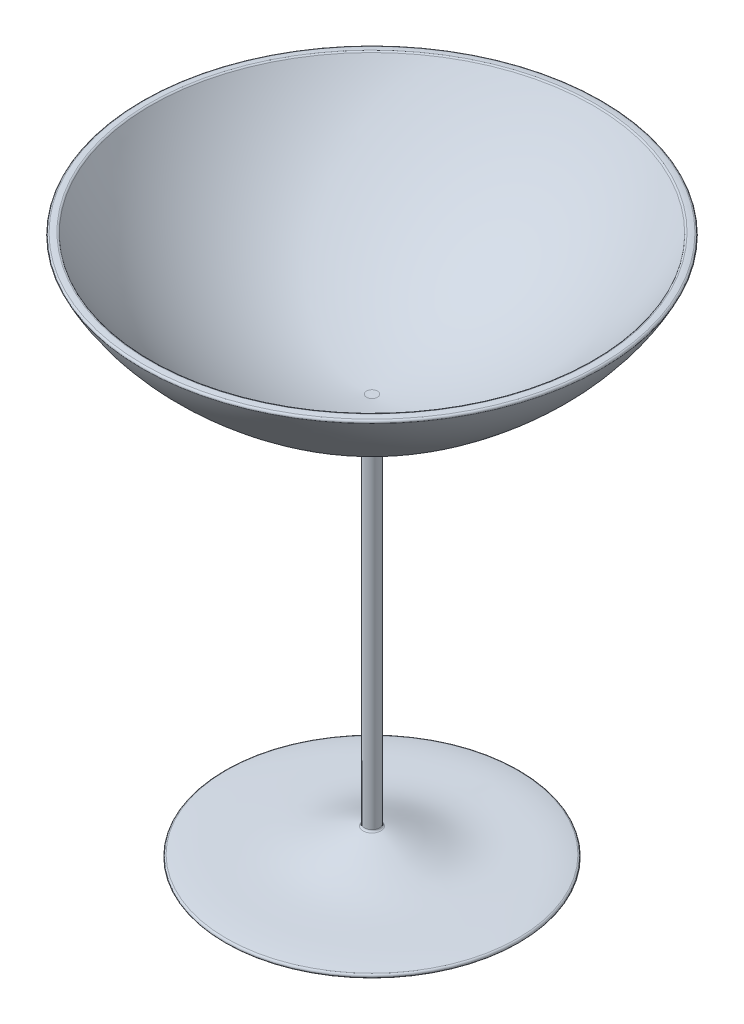
ISO-10303-21;
HEADER;
FILE_DESCRIPTION(('STEP AP214'),'2;1');
FILE_NAME('part.step','',(''),(''),'','','');
FILE_SCHEMA(('AUTOMOTIVE_DESIGN { 1 0 10303 214 1 1 1 1 }'));
ENDSEC;
DATA;
#1=APPLICATION_CONTEXT('core data for automotive mechanical design processes');
#2=APPLICATION_PROTOCOL_DEFINITION('international standard','automotive_design',2000,#1);
#3=PRODUCT_CONTEXT('',#1,'mechanical');
#4=PRODUCT('Part','Part','',(#3));
#5=PRODUCT_RELATED_PRODUCT_CATEGORY('part','',(#4));
#6=PRODUCT_DEFINITION_FORMATION('','',#4);
#7=PRODUCT_DEFINITION_CONTEXT('part definition',#1,'design');
#8=PRODUCT_DEFINITION('design','',#6,#7);
#9=PRODUCT_DEFINITION_SHAPE('','',#8);
#10=(LENGTH_UNIT() NAMED_UNIT(*) SI_UNIT(.MILLI.,.METRE.));
#11=(NAMED_UNIT(*) PLANE_ANGLE_UNIT() SI_UNIT($,.RADIAN.));
#12=(NAMED_UNIT(*) SI_UNIT($,.STERADIAN.) SOLID_ANGLE_UNIT());
#13=UNCERTAINTY_MEASURE_WITH_UNIT(LENGTH_MEASURE(1.E-05),#10,'distance_accuracy_value','');
#14=(GEOMETRIC_REPRESENTATION_CONTEXT(3) GLOBAL_UNCERTAINTY_ASSIGNED_CONTEXT((#13)) GLOBAL_UNIT_ASSIGNED_CONTEXT((#10,
#11,#12)) REPRESENTATION_CONTEXT('',''));
#15=CARTESIAN_POINT('',(0.,0.,0.));
#16=DIRECTION('',(0.,0.,1.));
#17=DIRECTION('',(1.,0.,0.));
#18=AXIS2_PLACEMENT_3D('',#15,#16,#17);
#19=CARTESIAN_POINT('',(-58.8099724506466,35.9343654235921,0.));
#20=CARTESIAN_POINT('',(-54.8437482154647,27.8216546404091,0.));
#21=CARTESIAN_POINT('',(-43.408922851671,16.7160100535124,0.));
#22=CARTESIAN_POINT('',(-23.8502860955776,4.006704857206,0.));
#23=CARTESIAN_POINT('',(-9.7039749809236,0.458813909786086,0.));
#24=CARTESIAN_POINT('',(-1.88664226698102,0.,0.));
#25=B_SPLINE_CURVE_WITH_KNOTS('',3,(#19,#20,#21,#22,#23,#24),.UNSPECIFIED.,.F.,.F.,(4,1,1,4),
(0.,0.387555223371887,0.662625528356687,1.),.UNSPECIFIED.);
#26=CARTESIAN_POINT('',(0.,0.,0.));
#27=DIRECTION('',(0.,-1.,0.));
#28=AXIS1_PLACEMENT('',#26,#27);
#29=SURFACE_OF_REVOLUTION('',#25,#28);
#30=CARTESIAN_POINT('',(0.,0.0291833860199861,0.));
#31=DIRECTION('',(0.,-1.,0.));
#32=DIRECTION('',(0.,0.,-1.));
#33=AXIS2_PLACEMENT_3D('',#30,#31,#32);
#34=CIRCLE('',#33,2.35355976735832);
#35=CARTESIAN_POINT('',(0.,0.0291833860199861,-2.35355976735832));
#36=VERTEX_POINT('',#35);
#37=EDGE_CURVE('E96',#36,#36,#34,.F.);
#38=ORIENTED_EDGE('',*,*,#37,.T.);
#39=EDGE_LOOP('',(#38));
#40=FACE_BOUND('',#39,.T.);
#41=CARTESIAN_POINT('',(0.,35.3237016730741,0.));
#42=DIRECTION('',(0.,-1.,0.));
#43=DIRECTION('',(0.,0.,-1.));
#44=AXIS2_PLACEMENT_3D('',#41,#42,#43);
#45=CIRCLE('',#44,58.5047650496406);
#46=CARTESIAN_POINT('',(0.,35.3237016730741,-58.5047650496406));
#47=VERTEX_POINT('',#46);
#48=EDGE_CURVE('E84',#47,#47,#45,.T.);
#49=ORIENTED_EDGE('',*,*,#48,.T.);
#50=EDGE_LOOP('',(#49));
#51=FACE_BOUND('',#50,.T.);
#52=ADVANCED_FACE('F39',(#40,#51),#29,.T.);
#53=CARTESIAN_POINT('',(0.,0.,0.));
#54=DIRECTION('',(0.,-1.,0.));
#55=DIRECTION('',(0.,0.,-1.));
#56=AXIS2_PLACEMENT_3D('',#53,#54,#55);
#57=CYLINDRICAL_SURFACE('',#56,1.88664226698102);
#58=CARTESIAN_POINT('',(0.,-0.469720961744908,0.));
#59=DIRECTION('',(0.,-1.,0.));
#60=DIRECTION('',(0.,0.,-1.));
#61=AXIS2_PLACEMENT_3D('',#58,#59,#60);
#62=CIRCLE('',#61,1.88664226698102);
#63=CARTESIAN_POINT('',(0.,-0.469720961744908,-1.88664226698102));
#64=VERTEX_POINT('',#63);
#65=EDGE_CURVE('E92',#64,#64,#62,.T.);
#66=ORIENTED_EDGE('',*,*,#65,.T.);
#67=EDGE_LOOP('',(#66));
#68=FACE_BOUND('',#67,.T.);
#69=CARTESIAN_POINT('',(0.,-94.2280124526305,0.));
#70=DIRECTION('',(0.,-1.,0.));
#71=DIRECTION('',(0.,0.,-1.));
#72=AXIS2_PLACEMENT_3D('',#69,#70,#71);
#73=CIRCLE('',#72,1.88664226698102);
#74=CARTESIAN_POINT('',(0.,-94.2280124526305,-1.88664226698102));
#75=VERTEX_POINT('',#74);
#76=EDGE_CURVE('E88',#75,#75,#73,.F.);
#77=ORIENTED_EDGE('',*,*,#76,.T.);
#78=EDGE_LOOP('',(#77));
#79=FACE_BOUND('',#78,.T.);
#80=ADVANCED_FACE('F124',(#68,#79),#57,.T.);
#81=CARTESIAN_POINT('',(-1.886642266981,-94.612786766603,0.));
#82=CARTESIAN_POINT('',(-6.83160133021266,-95.8914597771486,0.));
#83=CARTESIAN_POINT('',(-19.0710276502752,-102.372099831866,0.));
#84=CARTESIAN_POINT('',(-33.1184991777877,-99.281481970273,0.));
#85=CARTESIAN_POINT('',(-40.9460348130065,-101.993707721574,0.));
#86=B_SPLINE_CURVE_WITH_KNOTS('',3,(#81,#82,#83,#84,#85),.UNSPECIFIED.,.F.,.F.,(4,1,4),(0.,
0.38692208491526,1.),.UNSPECIFIED.);
#87=CARTESIAN_POINT('',(0.,0.,0.));
#88=DIRECTION('',(0.,-1.,0.));
#89=AXIS1_PLACEMENT('',#87,#88);
#90=SURFACE_OF_REVOLUTION('',#86,#89);
#91=CARTESIAN_POINT('',(0.,-94.7105831340178,0.));
#92=DIRECTION('',(0.,-1.,0.));
#93=DIRECTION('',(0.,0.,-1.));
#94=AXIS2_PLACEMENT_3D('',#91,#92,#93);
#95=CIRCLE('',#94,2.25577769016415);
#96=CARTESIAN_POINT('',(0.,-94.7105831340178,-2.25577769016415));
#97=VERTEX_POINT('',#96);
#98=EDGE_CURVE('E48',#97,#97,#95,.T.);
#99=ORIENTED_EDGE('',*,*,#98,.T.);
#100=EDGE_LOOP('',(#99));
#101=FACE_BOUND('',#100,.T.);
#102=CARTESIAN_POINT('',(0.,-101.001446244095,0.));
#103=DIRECTION('',(0.,-1.,0.));
#104=DIRECTION('',(0.,0.,-1.));
#105=AXIS2_PLACEMENT_3D('',#102,#103,#104);
#106=CIRCLE('',#105,37.0753147827534);
#107=CARTESIAN_POINT('',(0.,-101.001446244095,-37.0753147827534));
#108=VERTEX_POINT('',#107);
#109=EDGE_CURVE('E100',#108,#108,#106,.F.);
#110=ORIENTED_EDGE('',*,*,#109,.T.);
#111=EDGE_LOOP('',(#110));
#112=FACE_BOUND('',#111,.T.);
#113=ADVANCED_FACE('F107',(#101,#112),#90,.T.);
#114=CARTESIAN_POINT('',(-40.9460348130065,-101.993707721574,0.));
#115=DIRECTION('',(0.,1.,0.));
#116=DIRECTION('',(0.,0.,1.));
#117=AXIS2_PLACEMENT_3D('',#114,#115,#116);
#118=PLANE('',#117);
#119=CARTESIAN_POINT('',(0.,-101.993707721574,0.));
#120=DIRECTION('',(0.,1.,0.));
#121=DIRECTION('',(0.,0.,1.));
#122=AXIS2_PLACEMENT_3D('',#119,#120,#121);
#123=CIRCLE('',#122,36.9876869459105);
#124=CARTESIAN_POINT('',(0.,-101.993707721574,36.9876869459105));
#125=VERTEX_POINT('',#124);
#126=EDGE_CURVE('E11',#125,#125,#123,.F.);
#127=ORIENTED_EDGE('',*,*,#126,.T.);
#128=EDGE_LOOP('',(#127));
#129=FACE_BOUND('',#128,.T.);
#130=CARTESIAN_POINT('',(0.,-101.993707721574,0.));
#131=DIRECTION('',(0.,-1.,0.));
#132=DIRECTION('',(0.,0.,-1.));
#133=AXIS2_PLACEMENT_3D('',#130,#131,#132);
#134=CIRCLE('',#133,18.9765014233843);
#135=CARTESIAN_POINT('',(0.,-101.993707721574,-18.9765014233843));
#136=VERTEX_POINT('',#135);
#137=EDGE_CURVE('E62',#136,#136,#134,.T.);
#138=ORIENTED_EDGE('',*,*,#137,.F.);
#139=EDGE_LOOP('',(#138));
#140=FACE_BOUND('',#139,.T.);
#141=ADVANCED_FACE('F58',(#129,#140),#118,.F.);
#142=CARTESIAN_POINT('',(-18.9765014233843,-101.993707721574,0.));
#143=CARTESIAN_POINT('',(-15.1713852490726,-101.884491552982,0.));
#144=CARTESIAN_POINT('',(-8.88653025521581,-99.8981957021391,0.));
#145=CARTESIAN_POINT('',(-2.76483165077458,-97.5003939256202,0.));
#146=CARTESIAN_POINT('',(0.,-96.9917551921793,0.));
#147=B_SPLINE_CURVE_WITH_KNOTS('',3,(#142,#143,#144,#145,#146),.UNSPECIFIED.,.F.,.F.,(4,1,4),
(0.,0.572892545220291,1.),.UNSPECIFIED.);
#148=CARTESIAN_POINT('',(0.,0.,0.));
#149=DIRECTION('',(0.,-1.,0.));
#150=AXIS1_PLACEMENT('',#148,#149);
#151=SURFACE_OF_REVOLUTION('',#147,#150);
#152=CARTESIAN_POINT('',(0.,-96.9917551921793,0.));
#153=VERTEX_POINT('',#152);
#154=VERTEX_LOOP('',#153);
#155=FACE_BOUND('',#154,.T.);
#156=ORIENTED_EDGE('',*,*,#137,.T.);
#157=EDGE_LOOP('',(#156));
#158=FACE_BOUND('',#157,.T.);
#159=ADVANCED_FACE('F54',(#155,#158),#151,.T.);
#160=CARTESIAN_POINT('',(0.,0.457810216548592,0.));
#161=CARTESIAN_POINT('',(-0.461493172215436,0.430571080102952,0.));
#162=CARTESIAN_POINT('',(-0.925353782158308,0.41975204332183,0.));
#163=CARTESIAN_POINT('',(-1.38664215075466,0.457810216548592,0.));
#164=B_SPLINE_CURVE_WITH_KNOTS('',3,(#160,#161,#162,#163),.UNSPECIFIED.,.F.,.F.,(4,4),(0.,1.),.UNSPECIFIED.);
#165=CARTESIAN_POINT('',(0.,0.,0.));
#166=DIRECTION('',(0.,-1.,0.));
#167=AXIS1_PLACEMENT('',#165,#166);
#168=SURFACE_OF_REVOLUTION('',#164,#167);
#169=CARTESIAN_POINT('',(0.,0.457810216548592,0.));
#170=DIRECTION('',(0.,-1.,0.));
#171=DIRECTION('',(0.,0.,-1.));
#172=AXIS2_PLACEMENT_3D('',#169,#170,#171);
#173=CIRCLE('',#172,1.38664215075466);
#174=CARTESIAN_POINT('',(0.,0.457810216548592,-1.38664215075466));
#175=VERTEX_POINT('',#174);
#176=EDGE_CURVE('E66',#175,#175,#173,.T.);
#177=ORIENTED_EDGE('',*,*,#176,.F.);
#178=EDGE_LOOP('',(#177));
#179=FACE_BOUND('',#178,.T.);
#180=CARTESIAN_POINT('',(0.,0.457810216548592,0.));
#181=VERTEX_POINT('',#180);
#182=VERTEX_LOOP('',#181);
#183=FACE_BOUND('',#182,.T.);
#184=ADVANCED_FACE('F57',(#179,#183),#168,.T.);
#185=CARTESIAN_POINT('',(-1.38664215075466,0.457810216548592,0.));
#186=CARTESIAN_POINT('',(-1.4994415078602,0.467766744232663,0.));
#187=CARTESIAN_POINT('',(-1.6924332270684,0.484872477171678,0.));
#188=CARTESIAN_POINT('',(-3.11447068115182,0.609588511911078,0.));
#189=CARTESIAN_POINT('',(-5.84154174278769,0.938384794850599,0.));
#190=CARTESIAN_POINT('',(-11.2281182046289,1.96431479358336,0.));
#191=CARTESIAN_POINT('',(-18.0071603067472,3.97979304433477,0.));
#192=CARTESIAN_POINT('',(-25.7599248716999,7.41771241450778,0.));
#193=CARTESIAN_POINT('',(-35.5085719357092,13.2141678333271,0.));
#194=CARTESIAN_POINT('',(-44.2365338577566,20.6169764437588,0.));
#195=CARTESIAN_POINT('',(-51.6883724294894,29.2147207900518,0.));
#196=CARTESIAN_POINT('',(-54.930903774042,33.8185714845497,0.));
#197=CARTESIAN_POINT('',(-56.434457231932,36.2012014511968,0.));
#198=B_SPLINE_CURVE_WITH_KNOTS('',3,(#185,#186,#187,#188,#189,#190,#191,#192,#193,#194,#195,
#196,#197),.UNSPECIFIED.,.F.,.F.,(4,1,1,1,1,1,1,1,1,1,4),(-0.00665190499886085,
-0.00166297624971521,0.00166297624971521,0.056263839063568,0.119179583125997,0.245011071250854,
0.370842559375712,0.49667404750057,0.748337023750285,0.874168511875142,1.),.UNSPECIFIED.);
#199=CARTESIAN_POINT('',(0.,0.,0.));
#200=DIRECTION('',(0.,-1.,0.));
#201=AXIS1_PLACEMENT('',#199,#200);
#202=SURFACE_OF_REVOLUTION('',#198,#201);
#203=CARTESIAN_POINT('',(0.,35.9734325564316,0.));
#204=DIRECTION('',(0.,-1.,0.));
#205=DIRECTION('',(0.,0.,-1.));
#206=AXIS2_PLACEMENT_3D('',#203,#204,#205);
#207=CIRCLE('',#206,56.2902093361556);
#208=CARTESIAN_POINT('',(0.,35.9734325564316,-56.2902093361556));
#209=VERTEX_POINT('',#208);
#210=EDGE_CURVE('E80',#209,#209,#207,.F.);
#211=ORIENTED_EDGE('',*,*,#210,.T.);
#212=EDGE_LOOP('',(#211));
#213=FACE_BOUND('',#212,.T.);
#214=ORIENTED_EDGE('',*,*,#176,.T.);
#215=EDGE_LOOP('',(#214));
#216=FACE_BOUND('',#215,.T.);
#217=ADVANCED_FACE('F163',(#213,#216),#202,.T.);
#218=CARTESIAN_POINT('',(-56.434457231932,36.2012014511968,0.));
#219=CARTESIAN_POINT('',(-56.8471890483468,36.2215474566453,0.));
#220=CARTESIAN_POINT('',(-57.6428201603245,36.129901354328,0.));
#221=CARTESIAN_POINT('',(-58.4290706286481,35.9981155072185,0.));
#222=CARTESIAN_POINT('',(-58.8099724506466,35.9343654235921,0.));
#223=B_SPLINE_CURVE_WITH_KNOTS('',3,(#218,#219,#220,#221,#222),.UNSPECIFIED.,.F.,.F.,(4,1,4),
(0.,0.516317573311637,1.),.UNSPECIFIED.);
#224=CARTESIAN_POINT('',(0.,0.,0.));
#225=DIRECTION('',(0.,-1.,0.));
#226=AXIS1_PLACEMENT('',#224,#225);
#227=SURFACE_OF_REVOLUTION('',#223,#226);
#228=CARTESIAN_POINT('',(0.,36.2051371214749,0.));
#229=DIRECTION('',(0.,-1.,0.));
#230=DIRECTION('',(0.,0.,-1.));
#231=AXIS2_PLACEMENT_3D('',#228,#229,#230);
#232=CIRCLE('',#231,56.7219415553519);
#233=CARTESIAN_POINT('',(0.,36.2051371214749,-56.7219415553519));
#234=VERTEX_POINT('',#233);
#235=EDGE_CURVE('E71',#234,#234,#232,.T.);
#236=ORIENTED_EDGE('',*,*,#235,.T.);
#237=EDGE_LOOP('',(#236));
#238=FACE_BOUND('',#237,.T.);
#239=CARTESIAN_POINT('',(0.,36.0449470790465,0.));
#240=DIRECTION('',(0.,-1.,0.));
#241=DIRECTION('',(0.,0.,-1.));
#242=AXIS2_PLACEMENT_3D('',#239,#240,#241);
#243=CIRCLE('',#242,58.1378569218693);
#244=CARTESIAN_POINT('',(0.,36.0449470790465,-58.1378569218693));
#245=VERTEX_POINT('',#244);
#246=EDGE_CURVE('E65',#245,#245,#243,.F.);
#247=ORIENTED_EDGE('',*,*,#246,.T.);
#248=EDGE_LOOP('',(#247));
#249=FACE_BOUND('',#248,.T.);
#250=ADVANCED_FACE('F185',(#238,#249),#227,.T.);
#251=CARTESIAN_POINT('',(0.,35.7052322027894,0.));
#252=DIRECTION('',(0.,1.,0.));
#253=DIRECTION('',(0.,0.,1.));
#254=AXIS2_PLACEMENT_3D('',#251,#252,#253);
#255=TOROIDAL_SURFACE('',#254,56.7121910541318,0.5);
#256=ORIENTED_EDGE('',*,*,#210,.F.);
#257=EDGE_LOOP('',(#256));
#258=FACE_BOUND('',#257,.T.);
#259=ORIENTED_EDGE('',*,*,#235,.F.);
#260=EDGE_LOOP('',(#259));
#261=FACE_BOUND('',#260,.T.);
#262=ADVANCED_FACE('F136',(#258,#261),#255,.T.);
#263=CARTESIAN_POINT('',(0.,35.5511279615994,0.));
#264=DIRECTION('',(0.,1.,0.));
#265=DIRECTION('',(0.,0.,1.));
#266=AXIS2_PLACEMENT_3D('',#263,#264,#265);
#267=TOROIDAL_SURFACE('',#266,58.0594816754982,0.5);
#268=ORIENTED_EDGE('',*,*,#246,.F.);
#269=EDGE_LOOP('',(#268));
#270=FACE_BOUND('',#269,.T.);
#271=ORIENTED_EDGE('',*,*,#48,.F.);
#272=EDGE_LOOP('',(#271));
#273=FACE_BOUND('',#272,.T.);
#274=ADVANCED_FACE('F119',(#270,#273),#267,.T.);
#275=CARTESIAN_POINT('',(0.,-0.469720961744908,0.));
#276=DIRECTION('',(0.,-1.,0.));
#277=DIRECTION('',(0.,0.,-1.));
#278=AXIS2_PLACEMENT_3D('',#275,#276,#277);
#279=TOROIDAL_SURFACE('',#278,2.38664226698102,0.5);
#280=ORIENTED_EDGE('',*,*,#37,.F.);
#281=EDGE_LOOP('',(#280));
#282=FACE_BOUND('',#281,.T.);
#283=ORIENTED_EDGE('',*,*,#65,.F.);
#284=EDGE_LOOP('',(#283));
#285=FACE_BOUND('',#284,.T.);
#286=ADVANCED_FACE('F112',(#282,#285),#279,.F.);
#287=CARTESIAN_POINT('',(0.,-94.2280124526305,0.));
#288=DIRECTION('',(0.,-1.,0.));
#289=DIRECTION('',(0.,0.,-1.));
#290=AXIS2_PLACEMENT_3D('',#287,#288,#289);
#291=TOROIDAL_SURFACE('',#290,2.38664226698102,0.5);
#292=ORIENTED_EDGE('',*,*,#76,.F.);
#293=EDGE_LOOP('',(#292));
#294=FACE_BOUND('',#293,.T.);
#295=ORIENTED_EDGE('',*,*,#98,.F.);
#296=EDGE_LOOP('',(#295));
#297=FACE_BOUND('',#296,.T.);
#298=ADVANCED_FACE('F110',(#294,#297),#291,.F.);
#299=CARTESIAN_POINT('',(0.,-101.493707721574,0.));
#300=DIRECTION('',(0.,-1.,0.));
#301=DIRECTION('',(0.,0.,-1.));
#302=AXIS2_PLACEMENT_3D('',#299,#300,#301);
#303=TOROIDAL_SURFACE('',#302,36.9876869459105,0.5);
#304=ORIENTED_EDGE('',*,*,#109,.F.);
#305=EDGE_LOOP('',(#304));
#306=FACE_BOUND('',#305,.T.);
#307=ORIENTED_EDGE('',*,*,#126,.F.);
#308=EDGE_LOOP('',(#307));
#309=FACE_BOUND('',#308,.T.);
#310=ADVANCED_FACE('F41',(#306,#309),#303,.T.);
#311=CLOSED_SHELL('',(#52,#80,#113,#141,#159,#184,#217,#250,#262,#274,#286,#298,#310));
#312=MANIFOLD_SOLID_BREP('B2',#311);
#313=ADVANCED_BREP_SHAPE_REPRESENTATION('',(#18,#312),#14);
#314=SHAPE_DEFINITION_REPRESENTATION(#9,#313);
ENDSEC;
END-ISO-10303-21;
